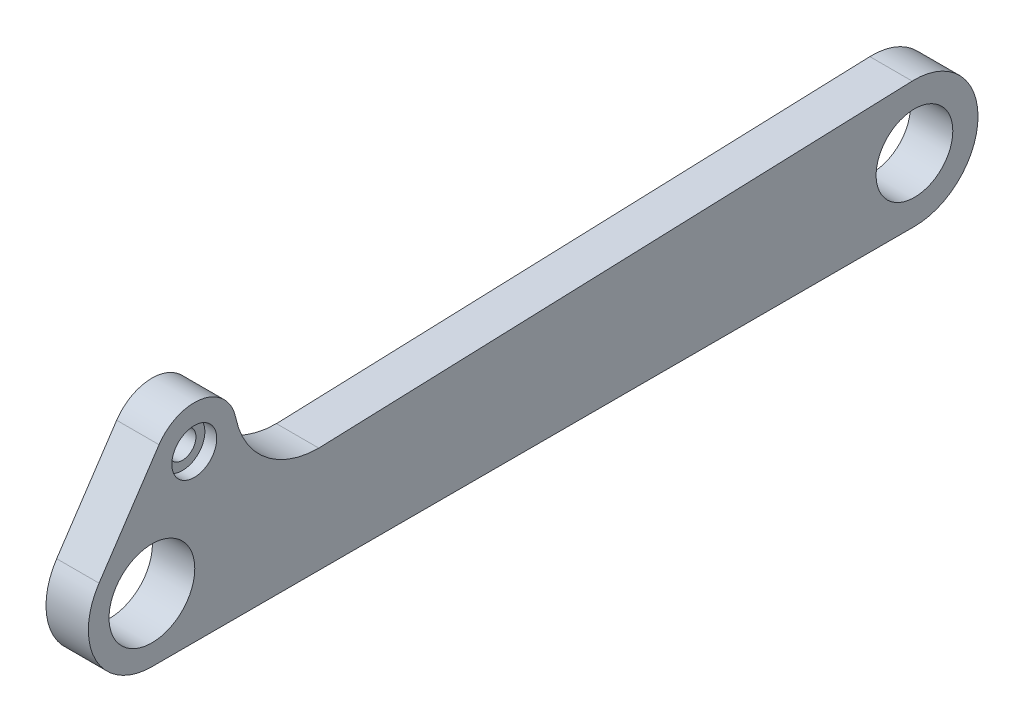
ISO-10303-21;
HEADER;
FILE_DESCRIPTION(('STEP AP214'),'2;1');
FILE_NAME('part.step','',(''),(''),'','','');
FILE_SCHEMA(('AUTOMOTIVE_DESIGN { 1 0 10303 214 1 1 1 1 }'));
ENDSEC;
DATA;
#1=APPLICATION_CONTEXT('core data for automotive mechanical design processes');
#2=APPLICATION_PROTOCOL_DEFINITION('international standard','automotive_design',2000,#1);
#3=PRODUCT_CONTEXT('',#1,'mechanical');
#4=PRODUCT('Part','Part','',(#3));
#5=PRODUCT_RELATED_PRODUCT_CATEGORY('part','',(#4));
#6=PRODUCT_DEFINITION_FORMATION('','',#4);
#7=PRODUCT_DEFINITION_CONTEXT('part definition',#1,'design');
#8=PRODUCT_DEFINITION('design','',#6,#7);
#9=PRODUCT_DEFINITION_SHAPE('','',#8);
#10=(LENGTH_UNIT() NAMED_UNIT(*) SI_UNIT(.MILLI.,.METRE.));
#11=(NAMED_UNIT(*) PLANE_ANGLE_UNIT() SI_UNIT($,.RADIAN.));
#12=(NAMED_UNIT(*) SI_UNIT($,.STERADIAN.) SOLID_ANGLE_UNIT());
#13=UNCERTAINTY_MEASURE_WITH_UNIT(LENGTH_MEASURE(1.E-05),#10,'distance_accuracy_value','');
#14=(GEOMETRIC_REPRESENTATION_CONTEXT(3) GLOBAL_UNCERTAINTY_ASSIGNED_CONTEXT((#13)) GLOBAL_UNIT_ASSIGNED_CONTEXT((#10,
#11,#12)) REPRESENTATION_CONTEXT('',''));
#15=CARTESIAN_POINT('',(0.,0.,0.));
#16=DIRECTION('',(0.,0.,1.));
#17=DIRECTION('',(1.,0.,0.));
#18=AXIS2_PLACEMENT_3D('',#15,#16,#17);
#19=CARTESIAN_POINT('',(-20.9981684182949,12.,-5.));
#20=DIRECTION('',(1.,0.,0.));
#21=DIRECTION('',(0.,0.,-1.));
#22=AXIS2_PLACEMENT_3D('',#19,#20,#21);
#23=CYLINDRICAL_SURFACE('',#22,1.6);
#24=CARTESIAN_POINT('',(0.,12.,-5.));
#25=DIRECTION('',(1.,0.,0.));
#26=DIRECTION('',(0.,0.,-1.));
#27=AXIS2_PLACEMENT_3D('',#24,#25,#26);
#28=CIRCLE('',#27,1.6);
#29=CARTESIAN_POINT('',(0.,12.,-6.6));
#30=VERTEX_POINT('',#29);
#31=EDGE_CURVE('E148',#30,#30,#28,.F.);
#32=ORIENTED_EDGE('',*,*,#31,.T.);
#33=EDGE_LOOP('',(#32));
#34=FACE_BOUND('',#33,.T.);
#35=CARTESIAN_POINT('',(3.6,12.,-5.));
#36=DIRECTION('',(1.,0.,0.));
#37=DIRECTION('',(0.,0.,-1.));
#38=AXIS2_PLACEMENT_3D('',#35,#36,#37);
#39=CIRCLE('',#38,1.6);
#40=CARTESIAN_POINT('',(3.6,12.,-6.6));
#41=VERTEX_POINT('',#40);
#42=EDGE_CURVE('E41',#41,#41,#39,.F.);
#43=ORIENTED_EDGE('',*,*,#42,.F.);
#44=EDGE_LOOP('',(#43));
#45=FACE_BOUND('',#44,.T.);
#46=ADVANCED_FACE('F37',(#34,#45),#23,.F.);
#47=CARTESIAN_POINT('',(5.,0.,0.));
#48=DIRECTION('',(1.,0.,0.));
#49=DIRECTION('',(0.,0.,-1.));
#50=AXIS2_PLACEMENT_3D('',#47,#48,#49);
#51=PLANE('',#50);
#52=CARTESIAN_POINT('',(5.,0.,0.));
#53=DIRECTION('',(1.,0.,0.));
#54=DIRECTION('',(0.,0.,-1.));
#55=AXIS2_PLACEMENT_3D('',#52,#53,#54);
#56=CIRCLE('',#55,5.06);
#57=CARTESIAN_POINT('',(5.,0.,-5.06));
#58=VERTEX_POINT('',#57);
#59=EDGE_CURVE('E226',#58,#58,#56,.T.);
#60=ORIENTED_EDGE('',*,*,#59,.F.);
#61=EDGE_LOOP('',(#60));
#62=FACE_BOUND('',#61,.T.);
#63=CARTESIAN_POINT('',(5.,0.,-90.));
#64=DIRECTION('',(1.,0.,0.));
#65=DIRECTION('',(0.,0.,-1.));
#66=AXIS2_PLACEMENT_3D('',#63,#64,#65);
#67=CIRCLE('',#66,4.525);
#68=CARTESIAN_POINT('',(5.,0.,-94.525));
#69=VERTEX_POINT('',#68);
#70=EDGE_CURVE('E123',#69,#69,#67,.T.);
#71=ORIENTED_EDGE('',*,*,#70,.F.);
#72=EDGE_LOOP('',(#71));
#73=FACE_BOUND('',#72,.T.);
#74=DIRECTION('',(0.,-0.0356054247974801,0.999365925837474));
#75=VECTOR('',#74,1.);
#76=CARTESIAN_POINT('',(5.,7.49524444378104,-89.7329593140189));
#77=LINE('',#76,#75);
#78=CARTESIAN_POINT('',(5.,7.49524444378104,-89.7329593140189));
#79=VERTEX_POINT('',#78);
#80=CARTESIAN_POINT('',(5.,5.,-19.6969384566991));
#81=VERTEX_POINT('',#80);
#82=EDGE_CURVE('E133',#79,#81,#77,.T.);
#83=ORIENTED_EDGE('',*,*,#82,.T.);
#84=CARTESIAN_POINT('',(5.,15.,-19.6969384566991));
#85=DIRECTION('',(1.,0.,0.));
#86=DIRECTION('',(0.,0.,-1.));
#87=AXIS2_PLACEMENT_3D('',#84,#85,#86);
#88=CIRCLE('',#87,10.);
#89=CARTESIAN_POINT('',(5.,13.,-9.89897948556636));
#90=VERTEX_POINT('',#89);
#91=EDGE_CURVE('E46',#81,#90,#88,.F.);
#92=ORIENTED_EDGE('',*,*,#91,.T.);
#93=CARTESIAN_POINT('',(5.,12.,-5.));
#94=DIRECTION('',(1.,0.,0.));
#95=DIRECTION('',(0.,0.,-1.));
#96=AXIS2_PLACEMENT_3D('',#93,#94,#95);
#97=CIRCLE('',#96,5.);
#98=CARTESIAN_POINT('',(5.,14.774756038783,-0.840585506920797));
#99=VERTEX_POINT('',#98);
#100=EDGE_CURVE('E119',#90,#99,#97,.T.);
#101=ORIENTED_EDGE('',*,*,#100,.T.);
#102=DIRECTION('',(0.,-0.83188289861584,0.5549512077566));
#103=VECTOR('',#102,1.);
#104=CARTESIAN_POINT('',(5.,4.1621340581745,6.2391217396188));
#105=LINE('',#104,#103);
#106=CARTESIAN_POINT('',(5.,4.1621340581745,6.2391217396188));
#107=VERTEX_POINT('',#106);
#108=EDGE_CURVE('E101',#99,#107,#105,.T.);
#109=ORIENTED_EDGE('',*,*,#108,.T.);
#110=CARTESIAN_POINT('',(5.,0.,0.));
#111=DIRECTION('',(1.,0.,0.));
#112=DIRECTION('',(0.,0.,-1.));
#113=AXIS2_PLACEMENT_3D('',#110,#111,#112);
#114=CIRCLE('',#113,7.5);
#115=CARTESIAN_POINT('',(5.,-7.5,0.));
#116=VERTEX_POINT('',#115);
#117=EDGE_CURVE('E108',#107,#116,#114,.T.);
#118=ORIENTED_EDGE('',*,*,#117,.T.);
#119=DIRECTION('',(0.,0.,-1.));
#120=VECTOR('',#119,1.);
#121=CARTESIAN_POINT('',(5.,-7.49999999999998,-90.));
#122=LINE('',#121,#120);
#123=CARTESIAN_POINT('',(5.,-7.49999999999998,-90.));
#124=VERTEX_POINT('',#123);
#125=EDGE_CURVE('E114',#116,#124,#122,.T.);
#126=ORIENTED_EDGE('',*,*,#125,.T.);
#127=CARTESIAN_POINT('',(5.,0.,-90.));
#128=DIRECTION('',(1.,0.,0.));
#129=DIRECTION('',(0.,0.,-1.));
#130=AXIS2_PLACEMENT_3D('',#127,#128,#129);
#131=CIRCLE('',#130,7.49999999999998);
#132=EDGE_CURVE('E130',#124,#79,#131,.T.);
#133=ORIENTED_EDGE('',*,*,#132,.T.);
#134=EDGE_LOOP('',(#83,#92,#101,#109,#118,#126,#133));
#135=FACE_BOUND('',#134,.T.);
#136=CARTESIAN_POINT('',(5.,12.,-5.));
#137=DIRECTION('',(1.,0.,0.));
#138=DIRECTION('',(0.,0.,-1.));
#139=AXIS2_PLACEMENT_3D('',#136,#137,#138);
#140=CIRCLE('',#139,2.65);
#141=CARTESIAN_POINT('',(5.,12.,-7.65));
#142=VERTEX_POINT('',#141);
#143=EDGE_CURVE('E144',#142,#142,#140,.T.);
#144=ORIENTED_EDGE('',*,*,#143,.F.);
#145=EDGE_LOOP('',(#144));
#146=FACE_BOUND('',#145,.T.);
#147=ADVANCED_FACE('F117',(#62,#73,#135,#146),#51,.T.);
#148=CARTESIAN_POINT('',(0.,0.,0.));
#149=DIRECTION('',(1.,0.,0.));
#150=DIRECTION('',(0.,0.,-1.));
#151=AXIS2_PLACEMENT_3D('',#148,#149,#150);
#152=PLANE('',#151);
#153=CARTESIAN_POINT('',(0.,0.,0.));
#154=DIRECTION('',(1.,0.,0.));
#155=DIRECTION('',(0.,0.,-1.));
#156=AXIS2_PLACEMENT_3D('',#153,#154,#155);
#157=CIRCLE('',#156,5.06);
#158=CARTESIAN_POINT('',(0.,0.,-5.06));
#159=VERTEX_POINT('',#158);
#160=EDGE_CURVE('E216',#159,#159,#157,.F.);
#161=ORIENTED_EDGE('',*,*,#160,.F.);
#162=EDGE_LOOP('',(#161));
#163=FACE_BOUND('',#162,.T.);
#164=CARTESIAN_POINT('',(0.,0.,-90.));
#165=DIRECTION('',(1.,0.,0.));
#166=DIRECTION('',(0.,0.,-1.));
#167=AXIS2_PLACEMENT_3D('',#164,#165,#166);
#168=CIRCLE('',#167,4.525);
#169=CARTESIAN_POINT('',(0.,0.,-94.525));
#170=VERTEX_POINT('',#169);
#171=EDGE_CURVE('E120',#170,#170,#168,.T.);
#172=ORIENTED_EDGE('',*,*,#171,.T.);
#173=EDGE_LOOP('',(#172));
#174=FACE_BOUND('',#173,.T.);
#175=CARTESIAN_POINT('',(0.,15.,-19.6969384566991));
#176=DIRECTION('',(1.,0.,0.));
#177=DIRECTION('',(0.,0.,-1.));
#178=AXIS2_PLACEMENT_3D('',#175,#176,#177);
#179=CIRCLE('',#178,10.);
#180=CARTESIAN_POINT('',(0.,13.,-9.89897948556636));
#181=VERTEX_POINT('',#180);
#182=CARTESIAN_POINT('',(0.,5.,-19.6969384566991));
#183=VERTEX_POINT('',#182);
#184=EDGE_CURVE('E11',#181,#183,#179,.T.);
#185=ORIENTED_EDGE('',*,*,#184,.T.);
#186=DIRECTION('',(0.,0.0356054247974801,-0.999365925837474));
#187=VECTOR('',#186,1.);
#188=CARTESIAN_POINT('',(0.,7.49524444378104,-89.7329593140189));
#189=LINE('',#188,#187);
#190=CARTESIAN_POINT('',(0.,7.49524444378104,-89.7329593140189));
#191=VERTEX_POINT('',#190);
#192=EDGE_CURVE('E126',#183,#191,#189,.T.);
#193=ORIENTED_EDGE('',*,*,#192,.T.);
#194=CARTESIAN_POINT('',(0.,0.,-90.));
#195=DIRECTION('',(1.,0.,0.));
#196=DIRECTION('',(0.,0.,-1.));
#197=AXIS2_PLACEMENT_3D('',#194,#195,#196);
#198=CIRCLE('',#197,7.49999999999998);
#199=CARTESIAN_POINT('',(0.,-7.49999999999998,-90.));
#200=VERTEX_POINT('',#199);
#201=EDGE_CURVE('E174',#191,#200,#198,.F.);
#202=ORIENTED_EDGE('',*,*,#201,.T.);
#203=DIRECTION('',(0.,0.,1.));
#204=VECTOR('',#203,1.);
#205=CARTESIAN_POINT('',(0.,-7.49999999999998,-90.));
#206=LINE('',#205,#204);
#207=CARTESIAN_POINT('',(0.,-7.5,0.));
#208=VERTEX_POINT('',#207);
#209=EDGE_CURVE('E170',#200,#208,#206,.T.);
#210=ORIENTED_EDGE('',*,*,#209,.T.);
#211=CARTESIAN_POINT('',(0.,0.,0.));
#212=DIRECTION('',(1.,0.,0.));
#213=DIRECTION('',(0.,0.,-1.));
#214=AXIS2_PLACEMENT_3D('',#211,#212,#213);
#215=CIRCLE('',#214,7.5);
#216=CARTESIAN_POINT('',(0.,4.1621340581745,6.23912173961879));
#217=VERTEX_POINT('',#216);
#218=EDGE_CURVE('E168',#208,#217,#215,.F.);
#219=ORIENTED_EDGE('',*,*,#218,.T.);
#220=DIRECTION('',(0.,0.83188289861584,-0.5549512077566));
#221=VECTOR('',#220,1.);
#222=CARTESIAN_POINT('',(0.,4.1621340581745,6.2391217396188));
#223=LINE('',#222,#221);
#224=CARTESIAN_POINT('',(0.,14.774756038783,-0.840585506920797));
#225=VERTEX_POINT('',#224);
#226=EDGE_CURVE('E102',#217,#225,#223,.T.);
#227=ORIENTED_EDGE('',*,*,#226,.T.);
#228=CARTESIAN_POINT('',(0.,12.,-5.));
#229=DIRECTION('',(1.,0.,0.));
#230=DIRECTION('',(0.,0.,-1.));
#231=AXIS2_PLACEMENT_3D('',#228,#229,#230);
#232=CIRCLE('',#231,5.);
#233=EDGE_CURVE('E53',#225,#181,#232,.F.);
#234=ORIENTED_EDGE('',*,*,#233,.T.);
#235=EDGE_LOOP('',(#185,#193,#202,#210,#219,#227,#234));
#236=FACE_BOUND('',#235,.T.);
#237=ORIENTED_EDGE('',*,*,#31,.F.);
#238=EDGE_LOOP('',(#237));
#239=FACE_BOUND('',#238,.T.);
#240=ADVANCED_FACE('F165',(#163,#174,#236,#239),#152,.F.);
#241=CARTESIAN_POINT('',(-20.9981684182949,12.,-5.));
#242=DIRECTION('',(1.,0.,0.));
#243=DIRECTION('',(0.,0.,-1.));
#244=AXIS2_PLACEMENT_3D('',#241,#242,#243);
#245=CYLINDRICAL_SURFACE('',#244,5.);
#246=DIRECTION('',(1.,0.,0.));
#247=VECTOR('',#246,1.);
#248=CARTESIAN_POINT('',(-107.336688772233,14.774756038783,-0.840585506920801));
#249=LINE('',#248,#247);
#250=EDGE_CURVE('E58',#225,#99,#249,.T.);
#251=ORIENTED_EDGE('',*,*,#250,.T.);
#252=ORIENTED_EDGE('',*,*,#100,.F.);
#253=DIRECTION('',(1.,0.,0.));
#254=VECTOR('',#253,1.);
#255=CARTESIAN_POINT('',(-20.9981684182949,13.,-9.89897948556636));
#256=LINE('',#255,#254);
#257=EDGE_CURVE('E155',#90,#181,#256,.F.);
#258=ORIENTED_EDGE('',*,*,#257,.T.);
#259=ORIENTED_EDGE('',*,*,#233,.F.);
#260=EDGE_LOOP('',(#251,#252,#258,#259));
#261=FACE_BOUND('',#260,.T.);
#262=ADVANCED_FACE('F161',(#261),#245,.T.);
#263=CARTESIAN_POINT('',(-20.9981684182949,15.,-19.6969384566991));
#264=DIRECTION('',(1.,0.,0.));
#265=DIRECTION('',(0.,0.,-1.));
#266=AXIS2_PLACEMENT_3D('',#263,#264,#265);
#267=CYLINDRICAL_SURFACE('',#266,10.);
#268=ORIENTED_EDGE('',*,*,#184,.F.);
#269=ORIENTED_EDGE('',*,*,#257,.F.);
#270=ORIENTED_EDGE('',*,*,#91,.F.);
#271=DIRECTION('',(1.,0.,0.));
#272=VECTOR('',#271,1.);
#273=CARTESIAN_POINT('',(5.,5.,-19.6969384566991));
#274=LINE('',#273,#272);
#275=EDGE_CURVE('E152',#183,#81,#274,.T.);
#276=ORIENTED_EDGE('',*,*,#275,.F.);
#277=EDGE_LOOP('',(#268,#269,#270,#276));
#278=FACE_BOUND('',#277,.T.);
#279=ADVANCED_FACE('F39',(#278),#267,.F.);
#280=CARTESIAN_POINT('',(3.6,12.,-5.));
#281=DIRECTION('',(1.,0.,0.));
#282=DIRECTION('',(0.,0.,-1.));
#283=AXIS2_PLACEMENT_3D('',#280,#281,#282);
#284=PLANE('',#283);
#285=CARTESIAN_POINT('',(3.6,12.,-5.));
#286=DIRECTION('',(1.,0.,0.));
#287=DIRECTION('',(0.,0.,-1.));
#288=AXIS2_PLACEMENT_3D('',#285,#286,#287);
#289=CIRCLE('',#288,2.65);
#290=CARTESIAN_POINT('',(3.6,12.,-7.65));
#291=VERTEX_POINT('',#290);
#292=EDGE_CURVE('E141',#291,#291,#289,.T.);
#293=ORIENTED_EDGE('',*,*,#292,.T.);
#294=EDGE_LOOP('',(#293));
#295=FACE_BOUND('',#294,.T.);
#296=ORIENTED_EDGE('',*,*,#42,.T.);
#297=EDGE_LOOP('',(#296));
#298=FACE_BOUND('',#297,.T.);
#299=ADVANCED_FACE('F193',(#295,#298),#284,.T.);
#300=CARTESIAN_POINT('',(3.6,12.,-5.));
#301=DIRECTION('',(1.,0.,0.));
#302=DIRECTION('',(0.,0.,-1.));
#303=AXIS2_PLACEMENT_3D('',#300,#301,#302);
#304=CYLINDRICAL_SURFACE('',#303,2.65);
#305=ORIENTED_EDGE('',*,*,#292,.F.);
#306=EDGE_LOOP('',(#305));
#307=FACE_BOUND('',#306,.T.);
#308=ORIENTED_EDGE('',*,*,#143,.T.);
#309=EDGE_LOOP('',(#308));
#310=FACE_BOUND('',#309,.T.);
#311=ADVANCED_FACE('F186',(#307,#310),#304,.F.);
#312=CARTESIAN_POINT('',(-107.336688772233,7.49524444378104,-89.7329593140189));
#313=DIRECTION('',(0.,0.999365925837474,0.0356054247974801));
#314=DIRECTION('',(0.,-0.0356054247974801,0.999365925837474));
#315=AXIS2_PLACEMENT_3D('',#312,#313,#314);
#316=PLANE('',#315);
#317=ORIENTED_EDGE('',*,*,#192,.F.);
#318=ORIENTED_EDGE('',*,*,#275,.T.);
#319=ORIENTED_EDGE('',*,*,#82,.F.);
#320=DIRECTION('',(1.,0.,0.));
#321=VECTOR('',#320,1.);
#322=CARTESIAN_POINT('',(-107.336688772233,7.49524444378104,-89.7329593140189));
#323=LINE('',#322,#321);
#324=EDGE_CURVE('E135',#191,#79,#323,.T.);
#325=ORIENTED_EDGE('',*,*,#324,.F.);
#326=EDGE_LOOP('',(#317,#318,#319,#325));
#327=FACE_BOUND('',#326,.T.);
#328=ADVANCED_FACE('F184',(#327),#316,.T.);
#329=CARTESIAN_POINT('',(-107.336688772233,0.,-90.));
#330=DIRECTION('',(1.,0.,0.));
#331=DIRECTION('',(0.,0.,-1.));
#332=AXIS2_PLACEMENT_3D('',#329,#330,#331);
#333=CYLINDRICAL_SURFACE('',#332,7.49999999999998);
#334=ORIENTED_EDGE('',*,*,#201,.F.);
#335=ORIENTED_EDGE('',*,*,#324,.T.);
#336=ORIENTED_EDGE('',*,*,#132,.F.);
#337=DIRECTION('',(1.,0.,0.));
#338=VECTOR('',#337,1.);
#339=CARTESIAN_POINT('',(-107.336688772233,-7.49999999999998,-90.));
#340=LINE('',#339,#338);
#341=EDGE_CURVE('E137',#200,#124,#340,.T.);
#342=ORIENTED_EDGE('',*,*,#341,.F.);
#343=EDGE_LOOP('',(#334,#335,#336,#342));
#344=FACE_BOUND('',#343,.T.);
#345=ADVANCED_FACE('F182',(#344),#333,.T.);
#346=CARTESIAN_POINT('',(-107.336688772233,-7.49999999999998,-90.));
#347=DIRECTION('',(0.,-1.,0.));
#348=DIRECTION('',(0.,0.,-1.));
#349=AXIS2_PLACEMENT_3D('',#346,#347,#348);
#350=PLANE('',#349);
#351=ORIENTED_EDGE('',*,*,#209,.F.);
#352=ORIENTED_EDGE('',*,*,#341,.T.);
#353=ORIENTED_EDGE('',*,*,#125,.F.);
#354=DIRECTION('',(1.,0.,0.));
#355=VECTOR('',#354,1.);
#356=CARTESIAN_POINT('',(-107.336688772233,-7.5,0.));
#357=LINE('',#356,#355);
#358=EDGE_CURVE('E105',#208,#116,#357,.T.);
#359=ORIENTED_EDGE('',*,*,#358,.F.);
#360=EDGE_LOOP('',(#351,#352,#353,#359));
#361=FACE_BOUND('',#360,.T.);
#362=ADVANCED_FACE('F180',(#361),#350,.T.);
#363=CARTESIAN_POINT('',(-107.336688772233,0.,0.));
#364=DIRECTION('',(1.,0.,0.));
#365=DIRECTION('',(0.,0.,-1.));
#366=AXIS2_PLACEMENT_3D('',#363,#364,#365);
#367=CYLINDRICAL_SURFACE('',#366,7.5);
#368=ORIENTED_EDGE('',*,*,#218,.F.);
#369=ORIENTED_EDGE('',*,*,#358,.T.);
#370=ORIENTED_EDGE('',*,*,#117,.F.);
#371=DIRECTION('',(1.,0.,0.));
#372=VECTOR('',#371,1.);
#373=CARTESIAN_POINT('',(-107.336688772233,4.1621340581745,6.2391217396188));
#374=LINE('',#373,#372);
#375=EDGE_CURVE('E97',#217,#107,#374,.T.);
#376=ORIENTED_EDGE('',*,*,#375,.F.);
#377=EDGE_LOOP('',(#368,#369,#370,#376));
#378=FACE_BOUND('',#377,.T.);
#379=ADVANCED_FACE('F109',(#378),#367,.T.);
#380=CARTESIAN_POINT('',(-107.336688772233,4.1621340581745,6.2391217396188));
#381=DIRECTION('',(0.,0.5549512077566,0.83188289861584));
#382=DIRECTION('',(0.,-0.83188289861584,0.5549512077566));
#383=AXIS2_PLACEMENT_3D('',#380,#381,#382);
#384=PLANE('',#383);
#385=ORIENTED_EDGE('',*,*,#226,.F.);
#386=ORIENTED_EDGE('',*,*,#375,.T.);
#387=ORIENTED_EDGE('',*,*,#108,.F.);
#388=ORIENTED_EDGE('',*,*,#250,.F.);
#389=EDGE_LOOP('',(#385,#386,#387,#388));
#390=FACE_BOUND('',#389,.T.);
#391=ADVANCED_FACE('F99',(#390),#384,.T.);
#392=CARTESIAN_POINT('',(0.,0.,-90.));
#393=DIRECTION('',(1.,0.,0.));
#394=DIRECTION('',(0.,0.,-1.));
#395=AXIS2_PLACEMENT_3D('',#392,#393,#394);
#396=CYLINDRICAL_SURFACE('',#395,4.525);
#397=ORIENTED_EDGE('',*,*,#171,.F.);
#398=EDGE_LOOP('',(#397));
#399=FACE_BOUND('',#398,.T.);
#400=ORIENTED_EDGE('',*,*,#70,.T.);
#401=EDGE_LOOP('',(#400));
#402=FACE_BOUND('',#401,.T.);
#403=ADVANCED_FACE('F219',(#399,#402),#396,.F.);
#404=CARTESIAN_POINT('',(-14.3118412512157,0.,0.));
#405=DIRECTION('',(1.,0.,0.));
#406=DIRECTION('',(0.,0.,-1.));
#407=AXIS2_PLACEMENT_3D('',#404,#405,#406);
#408=CYLINDRICAL_SURFACE('',#407,5.06);
#409=ORIENTED_EDGE('',*,*,#160,.T.);
#410=EDGE_LOOP('',(#409));
#411=FACE_BOUND('',#410,.T.);
#412=ORIENTED_EDGE('',*,*,#59,.T.);
#413=EDGE_LOOP('',(#412));
#414=FACE_BOUND('',#413,.T.);
#415=ADVANCED_FACE('F222',(#411,#414),#408,.F.);
#416=CLOSED_SHELL('',(#46,#147,#240,#262,#279,#299,#311,#328,#345,#362,#379,#391,#403,#415));
#417=MANIFOLD_SOLID_BREP('B2',#416);
#418=ADVANCED_BREP_SHAPE_REPRESENTATION('',(#18,#417),#14);
#419=SHAPE_DEFINITION_REPRESENTATION(#9,#418);
ENDSEC;
END-ISO-10303-21;
